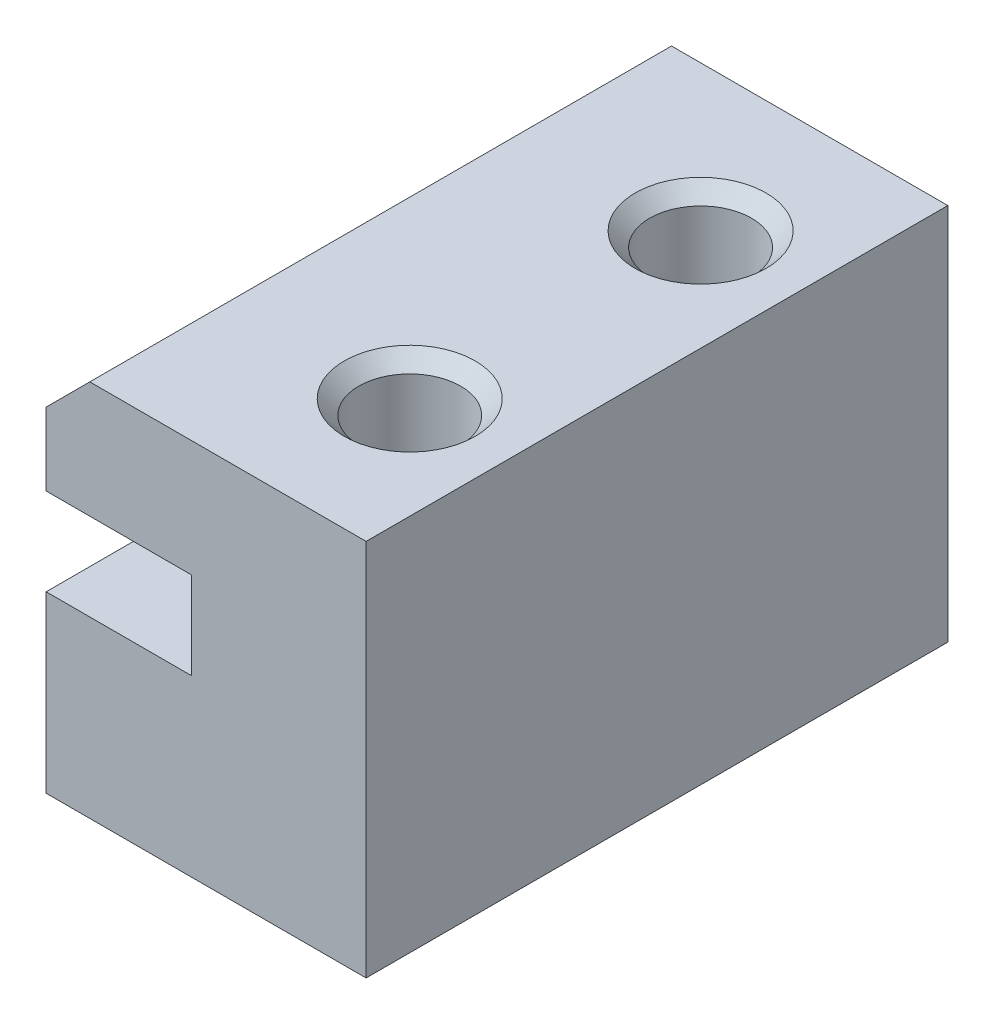
ISO-10303-21;
HEADER;
FILE_DESCRIPTION(('STEP AP214'),'2;1');
FILE_NAME('part.step','',(''),(''),'','','');
FILE_SCHEMA(('AUTOMOTIVE_DESIGN { 1 0 10303 214 1 1 1 1 }'));
ENDSEC;
DATA;
#1=APPLICATION_CONTEXT('core data for automotive mechanical design processes');
#2=APPLICATION_PROTOCOL_DEFINITION('international standard','automotive_design',2000,#1);
#3=PRODUCT_CONTEXT('',#1,'mechanical');
#4=PRODUCT('Part','Part','',(#3));
#5=PRODUCT_RELATED_PRODUCT_CATEGORY('part','',(#4));
#6=PRODUCT_DEFINITION_FORMATION('','',#4);
#7=PRODUCT_DEFINITION_CONTEXT('part definition',#1,'design');
#8=PRODUCT_DEFINITION('design','',#6,#7);
#9=PRODUCT_DEFINITION_SHAPE('','',#8);
#10=(LENGTH_UNIT() NAMED_UNIT(*) SI_UNIT(.MILLI.,.METRE.));
#11=(NAMED_UNIT(*) PLANE_ANGLE_UNIT() SI_UNIT($,.RADIAN.));
#12=(NAMED_UNIT(*) SI_UNIT($,.STERADIAN.) SOLID_ANGLE_UNIT());
#13=UNCERTAINTY_MEASURE_WITH_UNIT(LENGTH_MEASURE(1.E-05),#10,'distance_accuracy_value','');
#14=(GEOMETRIC_REPRESENTATION_CONTEXT(3) GLOBAL_UNCERTAINTY_ASSIGNED_CONTEXT((#13)) GLOBAL_UNIT_ASSIGNED_CONTEXT((#10,
#11,#12)) REPRESENTATION_CONTEXT('',''));
#15=CARTESIAN_POINT('',(0.,0.,0.));
#16=DIRECTION('',(0.,0.,1.));
#17=DIRECTION('',(1.,0.,0.));
#18=AXIS2_PLACEMENT_3D('',#15,#16,#17);
#19=CARTESIAN_POINT('',(0.,6.,10.));
#20=DIRECTION('',(1.,0.,0.));
#21=DIRECTION('',(0.,0.,-1.));
#22=AXIS2_PLACEMENT_3D('',#19,#20,#21);
#23=PLANE('',#22);
#24=DIRECTION('',(0.,-1.,0.));
#25=VECTOR('',#24,1.);
#26=CARTESIAN_POINT('',(0.,6.,-10.));
#27=LINE('',#26,#25);
#28=CARTESIAN_POINT('',(0.,6.,-10.));
#29=VERTEX_POINT('',#28);
#30=CARTESIAN_POINT('',(0.,0.,-10.));
#31=VERTEX_POINT('',#30);
#32=EDGE_CURVE('E129',#29,#31,#27,.T.);
#33=ORIENTED_EDGE('',*,*,#32,.T.);
#34=DIRECTION('',(0.,0.,-1.));
#35=VECTOR('',#34,1.);
#36=CARTESIAN_POINT('',(0.,0.,10.));
#37=LINE('',#36,#35);
#38=CARTESIAN_POINT('',(0.,0.,10.));
#39=VERTEX_POINT('',#38);
#40=EDGE_CURVE('E124',#39,#31,#37,.T.);
#41=ORIENTED_EDGE('',*,*,#40,.F.);
#42=DIRECTION('',(0.,-1.,0.));
#43=VECTOR('',#42,1.);
#44=CARTESIAN_POINT('',(0.,6.,10.));
#45=LINE('',#44,#43);
#46=CARTESIAN_POINT('',(0.,6.,10.));
#47=VERTEX_POINT('',#46);
#48=EDGE_CURVE('E157',#47,#39,#45,.T.);
#49=ORIENTED_EDGE('',*,*,#48,.F.);
#50=DIRECTION('',(0.,0.,-1.));
#51=VECTOR('',#50,1.);
#52=CARTESIAN_POINT('',(0.,6.,10.));
#53=LINE('',#52,#51);
#54=EDGE_CURVE('E179',#47,#29,#53,.T.);
#55=ORIENTED_EDGE('',*,*,#54,.T.);
#56=EDGE_LOOP('',(#33,#41,#49,#55));
#57=FACE_BOUND('',#56,.T.);
#58=ADVANCED_FACE('F45',(#57),#23,.F.);
#59=CARTESIAN_POINT('',(0.,0.,10.));
#60=DIRECTION('',(0.,1.,0.));
#61=DIRECTION('',(0.,0.,1.));
#62=AXIS2_PLACEMENT_3D('',#59,#60,#61);
#63=PLANE('',#62);
#64=CARTESIAN_POINT('',(7.5,0.,5.));
#65=DIRECTION('',(0.,1.,0.));
#66=DIRECTION('',(-1.,0.,0.));
#67=AXIS2_PLACEMENT_3D('',#64,#65,#66);
#68=CIRCLE('',#67,1.75);
#69=CARTESIAN_POINT('',(5.75,0.,5.));
#70=VERTEX_POINT('',#69);
#71=EDGE_CURVE('E150',#70,#70,#68,.T.);
#72=ORIENTED_EDGE('',*,*,#71,.T.);
#73=EDGE_LOOP('',(#72));
#74=FACE_BOUND('',#73,.T.);
#75=CARTESIAN_POINT('',(7.5,0.,-5.));
#76=DIRECTION('',(0.,1.,0.));
#77=DIRECTION('',(-1.,0.,0.));
#78=AXIS2_PLACEMENT_3D('',#75,#76,#77);
#79=CIRCLE('',#78,1.75);
#80=CARTESIAN_POINT('',(5.75,0.,-5.));
#81=VERTEX_POINT('',#80);
#82=EDGE_CURVE('E149',#81,#81,#79,.T.);
#83=ORIENTED_EDGE('',*,*,#82,.T.);
#84=EDGE_LOOP('',(#83));
#85=FACE_BOUND('',#84,.T.);
#86=DIRECTION('',(1.,0.,0.));
#87=VECTOR('',#86,1.);
#88=CARTESIAN_POINT('',(0.,0.,-10.));
#89=LINE('',#88,#87);
#90=CARTESIAN_POINT('',(11.,0.,-10.));
#91=VERTEX_POINT('',#90);
#92=EDGE_CURVE('E118',#31,#91,#89,.T.);
#93=ORIENTED_EDGE('',*,*,#92,.T.);
#94=DIRECTION('',(0.,0.,-1.));
#95=VECTOR('',#94,1.);
#96=CARTESIAN_POINT('',(11.,0.,10.));
#97=LINE('',#96,#95);
#98=CARTESIAN_POINT('',(11.,0.,10.));
#99=VERTEX_POINT('',#98);
#100=EDGE_CURVE('E122',#99,#91,#97,.T.);
#101=ORIENTED_EDGE('',*,*,#100,.F.);
#102=DIRECTION('',(1.,0.,0.));
#103=VECTOR('',#102,1.);
#104=CARTESIAN_POINT('',(0.,0.,10.));
#105=LINE('',#104,#103);
#106=EDGE_CURVE('E161',#39,#99,#105,.T.);
#107=ORIENTED_EDGE('',*,*,#106,.F.);
#108=ORIENTED_EDGE('',*,*,#40,.T.);
#109=EDGE_LOOP('',(#93,#101,#107,#108));
#110=FACE_BOUND('',#109,.T.);
#111=ADVANCED_FACE('F120',(#74,#85,#110),#63,.F.);
#112=CARTESIAN_POINT('',(15.,13.,10.));
#113=DIRECTION('',(0.,-1.,0.));
#114=DIRECTION('',(1.,0.,0.));
#115=AXIS2_PLACEMENT_3D('',#112,#113,#114);
#116=PLANE('',#115);
#117=CARTESIAN_POINT('',(7.5,13.,-5.));
#118=DIRECTION('',(0.,-1.,0.));
#119=DIRECTION('',(1.,0.,0.));
#120=AXIS2_PLACEMENT_3D('',#117,#118,#119);
#121=CIRCLE('',#120,2.25000000000001);
#122=CARTESIAN_POINT('',(9.75000000000001,13.,-5.));
#123=VERTEX_POINT('',#122);
#124=EDGE_CURVE('E55',#123,#123,#121,.T.);
#125=ORIENTED_EDGE('',*,*,#124,.T.);
#126=EDGE_LOOP('',(#125));
#127=FACE_BOUND('',#126,.T.);
#128=CARTESIAN_POINT('',(7.5,13.,5.));
#129=DIRECTION('',(0.,-1.,0.));
#130=DIRECTION('',(1.,0.,0.));
#131=AXIS2_PLACEMENT_3D('',#128,#129,#130);
#132=CIRCLE('',#131,2.25000000000001);
#133=CARTESIAN_POINT('',(9.75000000000001,13.,5.));
#134=VERTEX_POINT('',#133);
#135=EDGE_CURVE('E229',#134,#134,#132,.T.);
#136=ORIENTED_EDGE('',*,*,#135,.T.);
#137=EDGE_LOOP('',(#136));
#138=FACE_BOUND('',#137,.T.);
#139=DIRECTION('',(-1.,0.,0.));
#140=VECTOR('',#139,1.);
#141=CARTESIAN_POINT('',(15.,13.,10.));
#142=LINE('',#141,#140);
#143=CARTESIAN_POINT('',(11.,13.,10.));
#144=VERTEX_POINT('',#143);
#145=CARTESIAN_POINT('',(1.50000000000001,13.,10.));
#146=VERTEX_POINT('',#145);
#147=EDGE_CURVE('E62',#144,#146,#142,.T.);
#148=ORIENTED_EDGE('',*,*,#147,.F.);
#149=DIRECTION('',(0.,0.,1.));
#150=VECTOR('',#149,1.);
#151=CARTESIAN_POINT('',(11.,13.,-10.));
#152=LINE('',#151,#150);
#153=CARTESIAN_POINT('',(11.,13.,-10.));
#154=VERTEX_POINT('',#153);
#155=EDGE_CURVE('E137',#154,#144,#152,.T.);
#156=ORIENTED_EDGE('',*,*,#155,.F.);
#157=DIRECTION('',(-1.,0.,0.));
#158=VECTOR('',#157,1.);
#159=CARTESIAN_POINT('',(15.,13.,-10.));
#160=LINE('',#159,#158);
#161=CARTESIAN_POINT('',(1.50000000000001,13.,-10.));
#162=VERTEX_POINT('',#161);
#163=EDGE_CURVE('E69',#154,#162,#160,.T.);
#164=ORIENTED_EDGE('',*,*,#163,.T.);
#165=DIRECTION('',(0.,0.,1.));
#166=VECTOR('',#165,1.);
#167=CARTESIAN_POINT('',(1.50000000000001,13.,10.));
#168=LINE('',#167,#166);
#169=EDGE_CURVE('E219',#162,#146,#168,.T.);
#170=ORIENTED_EDGE('',*,*,#169,.T.);
#171=EDGE_LOOP('',(#148,#156,#164,#170));
#172=FACE_BOUND('',#171,.T.);
#173=ADVANCED_FACE('F236',(#127,#138,#172),#116,.F.);
#174=CARTESIAN_POINT('',(0.,13.,10.));
#175=DIRECTION('',(1.,0.,0.));
#176=DIRECTION('',(0.,1.,0.));
#177=AXIS2_PLACEMENT_3D('',#174,#175,#176);
#178=PLANE('',#177);
#179=DIRECTION('',(0.,-1.,0.));
#180=VECTOR('',#179,1.);
#181=CARTESIAN_POINT('',(0.,13.,10.));
#182=LINE('',#181,#180);
#183=CARTESIAN_POINT('',(0.,11.5,10.));
#184=VERTEX_POINT('',#183);
#185=CARTESIAN_POINT('',(0.,9.00000000000001,10.));
#186=VERTEX_POINT('',#185);
#187=EDGE_CURVE('E167',#184,#186,#182,.T.);
#188=ORIENTED_EDGE('',*,*,#187,.F.);
#189=DIRECTION('',(0.,0.,-1.));
#190=VECTOR('',#189,1.);
#191=CARTESIAN_POINT('',(0.,11.5,10.));
#192=LINE('',#191,#190);
#193=CARTESIAN_POINT('',(0.,11.5,-10.));
#194=VERTEX_POINT('',#193);
#195=EDGE_CURVE('E212',#184,#194,#192,.T.);
#196=ORIENTED_EDGE('',*,*,#195,.T.);
#197=DIRECTION('',(0.,-1.,0.));
#198=VECTOR('',#197,1.);
#199=CARTESIAN_POINT('',(0.,13.,-10.));
#200=LINE('',#199,#198);
#201=CARTESIAN_POINT('',(0.,9.00000000000001,-10.));
#202=VERTEX_POINT('',#201);
#203=EDGE_CURVE('E184',#194,#202,#200,.T.);
#204=ORIENTED_EDGE('',*,*,#203,.T.);
#205=DIRECTION('',(0.,0.,-1.));
#206=VECTOR('',#205,1.);
#207=CARTESIAN_POINT('',(0.,9.00000000000001,10.));
#208=LINE('',#207,#206);
#209=EDGE_CURVE('E206',#186,#202,#208,.T.);
#210=ORIENTED_EDGE('',*,*,#209,.F.);
#211=EDGE_LOOP('',(#188,#196,#204,#210));
#212=FACE_BOUND('',#211,.T.);
#213=ADVANCED_FACE('F258',(#212),#178,.F.);
#214=CARTESIAN_POINT('',(0.,9.00000000000001,10.));
#215=DIRECTION('',(0.,1.,0.));
#216=DIRECTION('',(-1.,0.,0.));
#217=AXIS2_PLACEMENT_3D('',#214,#215,#216);
#218=PLANE('',#217);
#219=DIRECTION('',(1.,0.,0.));
#220=VECTOR('',#219,1.);
#221=CARTESIAN_POINT('',(0.,9.00000000000001,-10.));
#222=LINE('',#221,#220);
#223=CARTESIAN_POINT('',(5.,9.,-10.));
#224=VERTEX_POINT('',#223);
#225=EDGE_CURVE('E187',#202,#224,#222,.T.);
#226=ORIENTED_EDGE('',*,*,#225,.T.);
#227=DIRECTION('',(0.,0.,-1.));
#228=VECTOR('',#227,1.);
#229=CARTESIAN_POINT('',(5.,9.,10.));
#230=LINE('',#229,#228);
#231=CARTESIAN_POINT('',(5.,9.,10.));
#232=VERTEX_POINT('',#231);
#233=EDGE_CURVE('E202',#232,#224,#230,.T.);
#234=ORIENTED_EDGE('',*,*,#233,.F.);
#235=DIRECTION('',(1.,0.,0.));
#236=VECTOR('',#235,1.);
#237=CARTESIAN_POINT('',(0.,9.00000000000001,10.));
#238=LINE('',#237,#236);
#239=EDGE_CURVE('E170',#186,#232,#238,.T.);
#240=ORIENTED_EDGE('',*,*,#239,.F.);
#241=ORIENTED_EDGE('',*,*,#209,.T.);
#242=EDGE_LOOP('',(#226,#234,#240,#241));
#243=FACE_BOUND('',#242,.T.);
#244=ADVANCED_FACE('F294',(#243),#218,.F.);
#245=CARTESIAN_POINT('',(5.,9.,10.));
#246=DIRECTION('',(1.,0.,0.));
#247=DIRECTION('',(0.,1.,0.));
#248=AXIS2_PLACEMENT_3D('',#245,#246,#247);
#249=PLANE('',#248);
#250=DIRECTION('',(0.,-1.,0.));
#251=VECTOR('',#250,1.);
#252=CARTESIAN_POINT('',(5.,9.,-10.));
#253=LINE('',#252,#251);
#254=CARTESIAN_POINT('',(5.,6.,-10.));
#255=VERTEX_POINT('',#254);
#256=EDGE_CURVE('E190',#224,#255,#253,.T.);
#257=ORIENTED_EDGE('',*,*,#256,.T.);
#258=DIRECTION('',(0.,0.,-1.));
#259=VECTOR('',#258,1.);
#260=CARTESIAN_POINT('',(5.,6.,10.));
#261=LINE('',#260,#259);
#262=CARTESIAN_POINT('',(5.,6.,10.));
#263=VERTEX_POINT('',#262);
#264=EDGE_CURVE('E198',#263,#255,#261,.T.);
#265=ORIENTED_EDGE('',*,*,#264,.F.);
#266=DIRECTION('',(0.,-1.,0.));
#267=VECTOR('',#266,1.);
#268=CARTESIAN_POINT('',(5.,9.,10.));
#269=LINE('',#268,#267);
#270=EDGE_CURVE('E173',#232,#263,#269,.T.);
#271=ORIENTED_EDGE('',*,*,#270,.F.);
#272=ORIENTED_EDGE('',*,*,#233,.T.);
#273=EDGE_LOOP('',(#257,#265,#271,#272));
#274=FACE_BOUND('',#273,.T.);
#275=ADVANCED_FACE('F300',(#274),#249,.F.);
#276=CARTESIAN_POINT('',(5.,6.,10.));
#277=DIRECTION('',(0.,-1.,0.));
#278=DIRECTION('',(0.,0.,-1.));
#279=AXIS2_PLACEMENT_3D('',#276,#277,#278);
#280=PLANE('',#279);
#281=DIRECTION('',(-1.,0.,0.));
#282=VECTOR('',#281,1.);
#283=CARTESIAN_POINT('',(5.,6.,-10.));
#284=LINE('',#283,#282);
#285=EDGE_CURVE('E162',#255,#29,#284,.T.);
#286=ORIENTED_EDGE('',*,*,#285,.T.);
#287=ORIENTED_EDGE('',*,*,#54,.F.);
#288=DIRECTION('',(-1.,0.,0.));
#289=VECTOR('',#288,1.);
#290=CARTESIAN_POINT('',(5.,6.,10.));
#291=LINE('',#290,#289);
#292=EDGE_CURVE('E176',#263,#47,#291,.T.);
#293=ORIENTED_EDGE('',*,*,#292,.F.);
#294=ORIENTED_EDGE('',*,*,#264,.T.);
#295=EDGE_LOOP('',(#286,#287,#293,#294));
#296=FACE_BOUND('',#295,.T.);
#297=ADVANCED_FACE('F304',(#296),#280,.F.);
#298=CARTESIAN_POINT('',(0.,0.,10.));
#299=DIRECTION('',(0.,0.,1.));
#300=DIRECTION('',(1.,0.,0.));
#301=AXIS2_PLACEMENT_3D('',#298,#299,#300);
#302=PLANE('',#301);
#303=ORIENTED_EDGE('',*,*,#106,.T.);
#304=DIRECTION('',(0.,-1.,0.));
#305=VECTOR('',#304,1.);
#306=CARTESIAN_POINT('',(11.,13.,10.));
#307=LINE('',#306,#305);
#308=EDGE_CURVE('E141',#144,#99,#307,.T.);
#309=ORIENTED_EDGE('',*,*,#308,.F.);
#310=ORIENTED_EDGE('',*,*,#147,.T.);
#311=DIRECTION('',(0.707106781186548,0.707106781186547,0.));
#312=VECTOR('',#311,1.);
#313=CARTESIAN_POINT('',(-5.75,5.75000000000001,10.));
#314=LINE('',#313,#312);
#315=EDGE_CURVE('E222',#146,#184,#314,.F.);
#316=ORIENTED_EDGE('',*,*,#315,.T.);
#317=ORIENTED_EDGE('',*,*,#187,.T.);
#318=ORIENTED_EDGE('',*,*,#239,.T.);
#319=ORIENTED_EDGE('',*,*,#270,.T.);
#320=ORIENTED_EDGE('',*,*,#292,.T.);
#321=ORIENTED_EDGE('',*,*,#48,.T.);
#322=EDGE_LOOP('',(#303,#309,#310,#316,#317,#318,#319,#320,#321));
#323=FACE_BOUND('',#322,.T.);
#324=ADVANCED_FACE('F286',(#323),#302,.T.);
#325=CARTESIAN_POINT('',(0.,0.,-10.));
#326=DIRECTION('',(0.,0.,1.));
#327=DIRECTION('',(1.,0.,0.));
#328=AXIS2_PLACEMENT_3D('',#325,#326,#327);
#329=PLANE('',#328);
#330=ORIENTED_EDGE('',*,*,#163,.F.);
#331=DIRECTION('',(0.,1.,0.));
#332=VECTOR('',#331,1.);
#333=CARTESIAN_POINT('',(11.,0.,-10.));
#334=LINE('',#333,#332);
#335=EDGE_CURVE('E132',#91,#154,#334,.T.);
#336=ORIENTED_EDGE('',*,*,#335,.F.);
#337=ORIENTED_EDGE('',*,*,#92,.F.);
#338=ORIENTED_EDGE('',*,*,#32,.F.);
#339=ORIENTED_EDGE('',*,*,#285,.F.);
#340=ORIENTED_EDGE('',*,*,#256,.F.);
#341=ORIENTED_EDGE('',*,*,#225,.F.);
#342=ORIENTED_EDGE('',*,*,#203,.F.);
#343=DIRECTION('',(-0.707106781186548,-0.707106781186547,0.));
#344=VECTOR('',#343,1.);
#345=CARTESIAN_POINT('',(0.,11.5,-10.));
#346=LINE('',#345,#344);
#347=EDGE_CURVE('E216',#194,#162,#346,.F.);
#348=ORIENTED_EDGE('',*,*,#347,.T.);
#349=EDGE_LOOP('',(#330,#336,#337,#338,#339,#340,#341,#342,#348));
#350=FACE_BOUND('',#349,.T.);
#351=ADVANCED_FACE('F133',(#350),#329,.F.);
#352=CARTESIAN_POINT('',(7.5,0.,-5.));
#353=DIRECTION('',(0.,1.,0.));
#354=DIRECTION('',(-1.,0.,0.));
#355=AXIS2_PLACEMENT_3D('',#352,#353,#354);
#356=CYLINDRICAL_SURFACE('',#355,1.75);
#357=CARTESIAN_POINT('',(7.5,12.5,-5.));
#358=DIRECTION('',(0.,-1.,0.));
#359=DIRECTION('',(0.,0.,-1.));
#360=AXIS2_PLACEMENT_3D('',#357,#358,#359);
#361=CIRCLE('',#360,1.75);
#362=CARTESIAN_POINT('',(7.5,12.5,-6.75));
#363=VERTEX_POINT('',#362);
#364=EDGE_CURVE('E225',#363,#363,#361,.F.);
#365=ORIENTED_EDGE('',*,*,#364,.T.);
#366=EDGE_LOOP('',(#365));
#367=FACE_BOUND('',#366,.T.);
#368=ORIENTED_EDGE('',*,*,#82,.F.);
#369=EDGE_LOOP('',(#368));
#370=FACE_BOUND('',#369,.T.);
#371=ADVANCED_FACE('F244',(#367,#370),#356,.F.);
#372=CARTESIAN_POINT('',(7.5,0.,5.));
#373=DIRECTION('',(0.,1.,0.));
#374=DIRECTION('',(-1.,0.,0.));
#375=AXIS2_PLACEMENT_3D('',#372,#373,#374);
#376=CYLINDRICAL_SURFACE('',#375,1.75);
#377=CARTESIAN_POINT('',(7.5,12.5,5.));
#378=DIRECTION('',(0.,-1.,0.));
#379=DIRECTION('',(0.,0.,-1.));
#380=AXIS2_PLACEMENT_3D('',#377,#378,#379);
#381=CIRCLE('',#380,1.75);
#382=CARTESIAN_POINT('',(7.5,12.5,3.25));
#383=VERTEX_POINT('',#382);
#384=EDGE_CURVE('E11',#383,#383,#381,.F.);
#385=ORIENTED_EDGE('',*,*,#384,.T.);
#386=EDGE_LOOP('',(#385));
#387=FACE_BOUND('',#386,.T.);
#388=ORIENTED_EDGE('',*,*,#71,.F.);
#389=EDGE_LOOP('',(#388));
#390=FACE_BOUND('',#389,.T.);
#391=ADVANCED_FACE('F247',(#387,#390),#376,.F.);
#392=CARTESIAN_POINT('',(0.,11.5,10.));
#393=DIRECTION('',(0.707106781186547,-0.707106781186548,0.));
#394=DIRECTION('',(0.,0.,-1.));
#395=AXIS2_PLACEMENT_3D('',#392,#393,#394);
#396=PLANE('',#395);
#397=ORIENTED_EDGE('',*,*,#315,.F.);
#398=ORIENTED_EDGE('',*,*,#169,.F.);
#399=ORIENTED_EDGE('',*,*,#347,.F.);
#400=ORIENTED_EDGE('',*,*,#195,.F.);
#401=EDGE_LOOP('',(#397,#398,#399,#400));
#402=FACE_BOUND('',#401,.T.);
#403=ADVANCED_FACE('F265',(#402),#396,.F.);
#404=CARTESIAN_POINT('',(11.,0.,0.));
#405=DIRECTION('',(1.,0.,0.));
#406=DIRECTION('',(0.,0.,-1.));
#407=AXIS2_PLACEMENT_3D('',#404,#405,#406);
#408=PLANE('',#407);
#409=ORIENTED_EDGE('',*,*,#100,.T.);
#410=ORIENTED_EDGE('',*,*,#335,.T.);
#411=ORIENTED_EDGE('',*,*,#155,.T.);
#412=ORIENTED_EDGE('',*,*,#308,.T.);
#413=EDGE_LOOP('',(#409,#410,#411,#412));
#414=FACE_BOUND('',#413,.T.);
#415=ADVANCED_FACE('F140',(#414),#408,.T.);
#416=CARTESIAN_POINT('',(7.5,12.5,-5.));
#417=DIRECTION('',(0.,1.,0.));
#418=DIRECTION('',(0.,0.,1.));
#419=AXIS2_PLACEMENT_3D('',#416,#417,#418);
#420=CONICAL_SURFACE('',#419,1.75,0.785398163397445);
#421=ORIENTED_EDGE('',*,*,#124,.F.);
#422=EDGE_LOOP('',(#421));
#423=FACE_BOUND('',#422,.T.);
#424=ORIENTED_EDGE('',*,*,#364,.F.);
#425=EDGE_LOOP('',(#424));
#426=FACE_BOUND('',#425,.T.);
#427=ADVANCED_FACE('F239',(#423,#426),#420,.F.);
#428=CARTESIAN_POINT('',(7.5,12.5,5.));
#429=DIRECTION('',(0.,1.,0.));
#430=DIRECTION('',(0.,0.,1.));
#431=AXIS2_PLACEMENT_3D('',#428,#429,#430);
#432=CONICAL_SURFACE('',#431,1.75,0.785398163397445);
#433=ORIENTED_EDGE('',*,*,#135,.F.);
#434=EDGE_LOOP('',(#433));
#435=FACE_BOUND('',#434,.T.);
#436=ORIENTED_EDGE('',*,*,#384,.F.);
#437=EDGE_LOOP('',(#436));
#438=FACE_BOUND('',#437,.T.);
#439=ADVANCED_FACE('F48',(#435,#438),#432,.F.);
#440=CLOSED_SHELL('',(#58,#111,#173,#213,#244,#275,#297,#324,#351,#371,#391,#403,#415,#427,#439));
#441=MANIFOLD_SOLID_BREP('B2',#440);
#442=ADVANCED_BREP_SHAPE_REPRESENTATION('',(#18,#441),#14);
#443=SHAPE_DEFINITION_REPRESENTATION(#9,#442);
ENDSEC;
END-ISO-10303-21;
